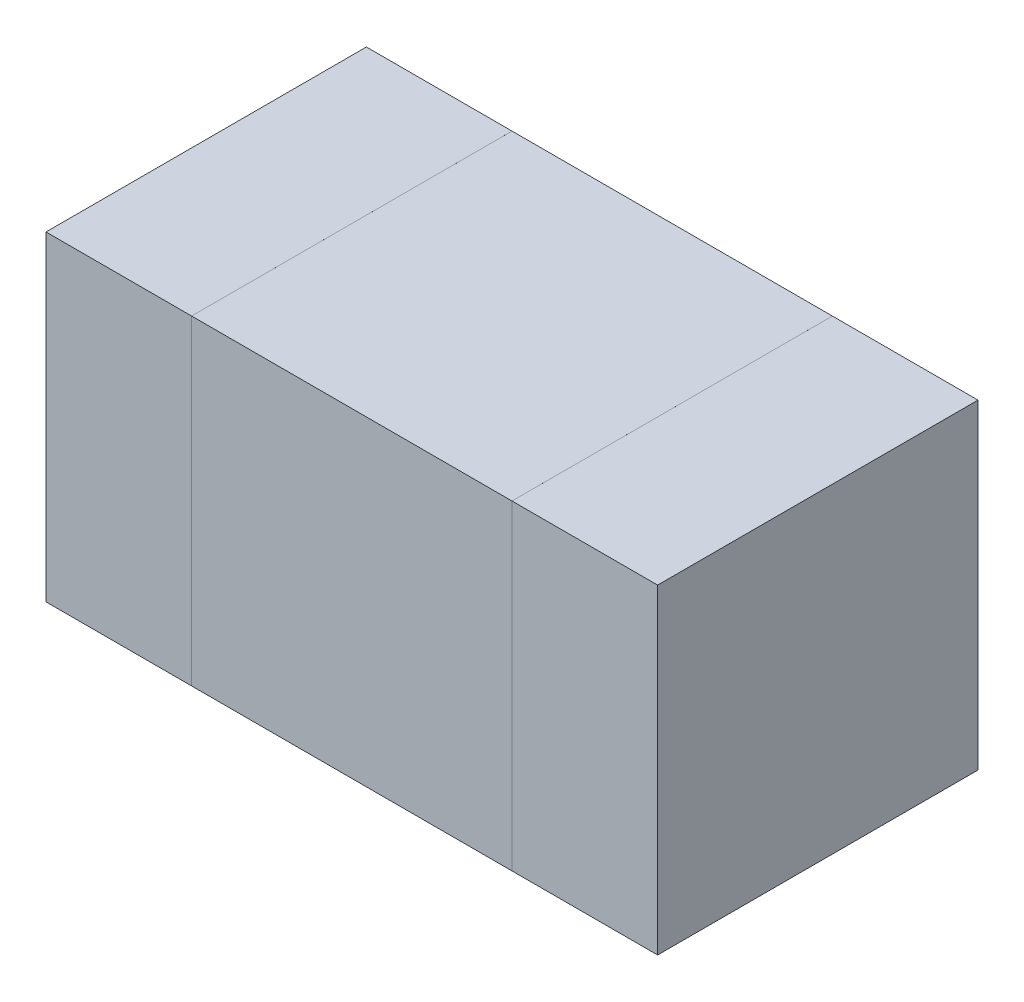
ISO-10303-21;
HEADER;
FILE_DESCRIPTION(('STEP AP214'),'2;1');
FILE_NAME('part.step','',(''),(''),'','','');
FILE_SCHEMA(('AUTOMOTIVE_DESIGN { 1 0 10303 214 1 1 1 1 }'));
ENDSEC;
DATA;
#1=APPLICATION_CONTEXT('core data for automotive mechanical design processes');
#2=APPLICATION_PROTOCOL_DEFINITION('international standard','automotive_design',2000,#1);
#3=PRODUCT_CONTEXT('',#1,'mechanical');
#4=PRODUCT('Part','Part','',(#3));
#5=PRODUCT_RELATED_PRODUCT_CATEGORY('part','',(#4));
#6=PRODUCT_DEFINITION_FORMATION('','',#4);
#7=PRODUCT_DEFINITION_CONTEXT('part definition',#1,'design');
#8=PRODUCT_DEFINITION('design','',#6,#7);
#9=PRODUCT_DEFINITION_SHAPE('','',#8);
#10=(LENGTH_UNIT() NAMED_UNIT(*) SI_UNIT(.MILLI.,.METRE.));
#11=(NAMED_UNIT(*) PLANE_ANGLE_UNIT() SI_UNIT($,.RADIAN.));
#12=(NAMED_UNIT(*) SI_UNIT($,.STERADIAN.) SOLID_ANGLE_UNIT());
#13=UNCERTAINTY_MEASURE_WITH_UNIT(LENGTH_MEASURE(1.E-05),#10,'distance_accuracy_value','');
#14=(GEOMETRIC_REPRESENTATION_CONTEXT(3) GLOBAL_UNCERTAINTY_ASSIGNED_CONTEXT((#13)) GLOBAL_UNIT_ASSIGNED_CONTEXT((#10,
#11,#12)) REPRESENTATION_CONTEXT('',''));
#15=CARTESIAN_POINT('',(0.,0.,0.));
#16=DIRECTION('',(0.,0.,1.));
#17=DIRECTION('',(1.,0.,0.));
#18=AXIS2_PLACEMENT_3D('',#15,#16,#17);
#19=CARTESIAN_POINT('',(5.709996696289,13.75999131668,0.32999934));
#20=DIRECTION('',(0.,0.,-1.));
#21=DIRECTION('',(0.,-1.,0.));
#22=AXIS2_PLACEMENT_3D('',#19,#20,#21);
#23=PLANE('',#22);
#24=DIRECTION('',(0.,1.,0.));
#25=VECTOR('',#24,1.);
#26=CARTESIAN_POINT('',(5.709996696289,13.75999131668,0.32999934));
#27=LINE('',#26,#25);
#28=CARTESIAN_POINT('',(5.709996696289,13.75999131668,0.32999934));
#29=VERTEX_POINT('',#28);
#30=CARTESIAN_POINT('',(5.709996696289,14.08999319668,0.32999934));
#31=VERTEX_POINT('',#30);
#32=EDGE_CURVE('P0_E79',#29,#31,#27,.T.);
#33=ORIENTED_EDGE('',*,*,#32,.T.);
#34=DIRECTION('',(-1.,0.,0.));
#35=VECTOR('',#34,1.);
#36=CARTESIAN_POINT('',(5.709996696289,14.08999319668,0.32999934));
#37=LINE('',#36,#35);
#38=CARTESIAN_POINT('',(5.559994456289,14.08999319668,0.32999934));
#39=VERTEX_POINT('',#38);
#40=EDGE_CURVE('P0_E105',#31,#39,#37,.T.);
#41=ORIENTED_EDGE('',*,*,#40,.T.);
#42=DIRECTION('',(0.,-1.,0.));
#43=VECTOR('',#42,1.);
#44=CARTESIAN_POINT('',(5.559994456289,14.08999319668,0.32999934));
#45=LINE('',#44,#43);
#46=CARTESIAN_POINT('',(5.559994456289,13.75999131668,0.32999934));
#47=VERTEX_POINT('',#46);
#48=EDGE_CURVE('P0_E20',#39,#47,#45,.T.);
#49=ORIENTED_EDGE('',*,*,#48,.T.);
#50=DIRECTION('',(1.,0.,0.));
#51=VECTOR('',#50,1.);
#52=CARTESIAN_POINT('',(5.559994456289,13.75999131668,0.32999934));
#53=LINE('',#52,#51);
#54=EDGE_CURVE('P0_E11',#47,#29,#53,.T.);
#55=ORIENTED_EDGE('',*,*,#54,.T.);
#56=EDGE_LOOP('',(#33,#41,#49,#55));
#57=FACE_BOUND('',#56,.T.);
#58=ADVANCED_FACE('P0_F17',(#57),#23,.F.);
#59=CARTESIAN_POINT('',(5.709996696289,13.75999131668,0.));
#60=DIRECTION('',(0.,0.,-1.));
#61=DIRECTION('',(0.,-1.,0.));
#62=AXIS2_PLACEMENT_3D('',#59,#60,#61);
#63=PLANE('',#62);
#64=DIRECTION('',(1.,0.,0.));
#65=VECTOR('',#64,1.);
#66=CARTESIAN_POINT('',(5.559994456289,13.75999131668,0.));
#67=LINE('',#66,#65);
#68=CARTESIAN_POINT('',(5.559994456289,13.75999131668,0.));
#69=VERTEX_POINT('',#68);
#70=CARTESIAN_POINT('',(5.709996696289,13.75999131668,0.));
#71=VERTEX_POINT('',#70);
#72=EDGE_CURVE('P0_E27',#69,#71,#67,.T.);
#73=ORIENTED_EDGE('',*,*,#72,.F.);
#74=DIRECTION('',(0.,-1.,0.));
#75=VECTOR('',#74,1.);
#76=CARTESIAN_POINT('',(5.559994456289,14.08999319668,0.));
#77=LINE('',#76,#75);
#78=CARTESIAN_POINT('',(5.559994456289,14.08999319668,0.));
#79=VERTEX_POINT('',#78);
#80=EDGE_CURVE('P0_E94',#79,#69,#77,.T.);
#81=ORIENTED_EDGE('',*,*,#80,.F.);
#82=DIRECTION('',(-1.,0.,0.));
#83=VECTOR('',#82,1.);
#84=CARTESIAN_POINT('',(5.709996696289,14.08999319668,0.));
#85=LINE('',#84,#83);
#86=CARTESIAN_POINT('',(5.709996696289,14.08999319668,0.));
#87=VERTEX_POINT('',#86);
#88=EDGE_CURVE('P0_E81',#87,#79,#85,.T.);
#89=ORIENTED_EDGE('',*,*,#88,.F.);
#90=DIRECTION('',(0.,1.,0.));
#91=VECTOR('',#90,1.);
#92=CARTESIAN_POINT('',(5.709996696289,13.75999131668,0.));
#93=LINE('',#92,#91);
#94=EDGE_CURVE('P0_E77',#71,#87,#93,.T.);
#95=ORIENTED_EDGE('',*,*,#94,.F.);
#96=EDGE_LOOP('',(#73,#81,#89,#95));
#97=FACE_BOUND('',#96,.T.);
#98=ADVANCED_FACE('P0_F83',(#97),#63,.T.);
#99=CARTESIAN_POINT('',(5.559994456289,13.75999131668,0.));
#100=DIRECTION('',(0.,1.,0.));
#101=DIRECTION('',(1.,0.,0.));
#102=AXIS2_PLACEMENT_3D('',#99,#100,#101);
#103=PLANE('',#102);
#104=ORIENTED_EDGE('',*,*,#72,.T.);
#105=DIRECTION('',(0.,0.,1.));
#106=VECTOR('',#105,1.);
#107=CARTESIAN_POINT('',(5.709996696289,13.75999131668,0.));
#108=LINE('',#107,#106);
#109=EDGE_CURVE('P0_E64',#71,#29,#108,.T.);
#110=ORIENTED_EDGE('',*,*,#109,.T.);
#111=ORIENTED_EDGE('',*,*,#54,.F.);
#112=DIRECTION('',(0.,0.,1.));
#113=VECTOR('',#112,1.);
#114=CARTESIAN_POINT('',(5.559994456289,13.75999131668,0.));
#115=LINE('',#114,#113);
#116=EDGE_CURVE('P0_E67',#69,#47,#115,.T.);
#117=ORIENTED_EDGE('',*,*,#116,.F.);
#118=EDGE_LOOP('',(#104,#110,#111,#117));
#119=FACE_BOUND('',#118,.T.);
#120=ADVANCED_FACE('P0_F63',(#119),#103,.F.);
#121=CARTESIAN_POINT('',(5.559994456289,14.08999319668,0.));
#122=DIRECTION('',(1.,0.,0.));
#123=DIRECTION('',(0.,1.,0.));
#124=AXIS2_PLACEMENT_3D('',#121,#122,#123);
#125=PLANE('',#124);
#126=ORIENTED_EDGE('',*,*,#80,.T.);
#127=ORIENTED_EDGE('',*,*,#116,.T.);
#128=ORIENTED_EDGE('',*,*,#48,.F.);
#129=DIRECTION('',(0.,0.,1.));
#130=VECTOR('',#129,1.);
#131=CARTESIAN_POINT('',(5.559994456289,14.08999319668,0.));
#132=LINE('',#131,#130);
#133=EDGE_CURVE('P0_E102',#79,#39,#132,.T.);
#134=ORIENTED_EDGE('',*,*,#133,.F.);
#135=EDGE_LOOP('',(#126,#127,#128,#134));
#136=FACE_BOUND('',#135,.T.);
#137=ADVANCED_FACE('P0_F114',(#136),#125,.F.);
#138=CARTESIAN_POINT('',(5.709996696289,14.08999319668,0.));
#139=DIRECTION('',(0.,-1.,0.));
#140=DIRECTION('',(0.,0.,-1.));
#141=AXIS2_PLACEMENT_3D('',#138,#139,#140);
#142=PLANE('',#141);
#143=ORIENTED_EDGE('',*,*,#88,.T.);
#144=ORIENTED_EDGE('',*,*,#133,.T.);
#145=ORIENTED_EDGE('',*,*,#40,.F.);
#146=DIRECTION('',(0.,0.,1.));
#147=VECTOR('',#146,1.);
#148=CARTESIAN_POINT('',(5.709996696289,14.08999319668,0.));
#149=LINE('',#148,#147);
#150=EDGE_CURVE('P0_E87',#87,#31,#149,.T.);
#151=ORIENTED_EDGE('',*,*,#150,.F.);
#152=EDGE_LOOP('',(#143,#144,#145,#151));
#153=FACE_BOUND('',#152,.T.);
#154=ADVANCED_FACE('P0_F117',(#153),#142,.F.);
#155=CARTESIAN_POINT('',(5.709996696289,13.75999131668,0.));
#156=DIRECTION('',(-1.,0.,0.));
#157=DIRECTION('',(0.,0.,1.));
#158=AXIS2_PLACEMENT_3D('',#155,#156,#157);
#159=PLANE('',#158);
#160=ORIENTED_EDGE('',*,*,#94,.T.);
#161=ORIENTED_EDGE('',*,*,#150,.T.);
#162=ORIENTED_EDGE('',*,*,#32,.F.);
#163=ORIENTED_EDGE('',*,*,#109,.F.);
#164=EDGE_LOOP('',(#160,#161,#162,#163));
#165=FACE_BOUND('',#164,.T.);
#166=ADVANCED_FACE('P0_F75',(#165),#159,.F.);
#167=CLOSED_SHELL('',(#58,#98,#120,#137,#154,#166));
#168=MANIFOLD_SOLID_BREP('P0_B1',#167);
#169=CARTESIAN_POINT('',(6.190007682617,13.75999131668,0.32999934));
#170=DIRECTION('',(0.,0.,-1.));
#171=DIRECTION('',(0.,-1.,0.));
#172=AXIS2_PLACEMENT_3D('',#169,#170,#171);
#173=PLANE('',#172);
#174=DIRECTION('',(0.,1.,0.));
#175=VECTOR('',#174,1.);
#176=CARTESIAN_POINT('',(6.190007682617,13.75999131668,0.32999934));
#177=LINE('',#176,#175);
#178=CARTESIAN_POINT('',(6.190007682617,13.75999131668,0.32999934));
#179=VERTEX_POINT('',#178);
#180=CARTESIAN_POINT('',(6.190007682617,14.08999319668,0.32999934));
#181=VERTEX_POINT('',#180);
#182=EDGE_CURVE('P1_E76',#179,#181,#177,.T.);
#183=ORIENTED_EDGE('',*,*,#182,.T.);
#184=DIRECTION('',(-1.,0.,0.));
#185=VECTOR('',#184,1.);
#186=CARTESIAN_POINT('',(6.190007682617,14.08999319668,0.32999934));
#187=LINE('',#186,#185);
#188=CARTESIAN_POINT('',(6.040005442617,14.08999319668,0.32999934));
#189=VERTEX_POINT('',#188);
#190=EDGE_CURVE('P1_E74',#181,#189,#187,.T.);
#191=ORIENTED_EDGE('',*,*,#190,.T.);
#192=DIRECTION('',(0.,-1.,0.));
#193=VECTOR('',#192,1.);
#194=CARTESIAN_POINT('',(6.040005442617,14.08999319668,0.32999934));
#195=LINE('',#194,#193);
#196=CARTESIAN_POINT('',(6.040005442617,13.75999131668,0.32999934));
#197=VERTEX_POINT('',#196);
#198=EDGE_CURVE('P1_E63',#189,#197,#195,.T.);
#199=ORIENTED_EDGE('',*,*,#198,.T.);
#200=DIRECTION('',(1.,0.,0.));
#201=VECTOR('',#200,1.);
#202=CARTESIAN_POINT('',(6.040005442617,13.75999131668,0.32999934));
#203=LINE('',#202,#201);
#204=EDGE_CURVE('P1_E11',#197,#179,#203,.T.);
#205=ORIENTED_EDGE('',*,*,#204,.T.);
#206=EDGE_LOOP('',(#183,#191,#199,#205));
#207=FACE_BOUND('',#206,.T.);
#208=ADVANCED_FACE('P1_F17',(#207),#173,.F.);
#209=CARTESIAN_POINT('',(6.190007682617,13.75999131668,0.));
#210=DIRECTION('',(0.,0.,-1.));
#211=DIRECTION('',(0.,-1.,0.));
#212=AXIS2_PLACEMENT_3D('',#209,#210,#211);
#213=PLANE('',#212);
#214=DIRECTION('',(1.,0.,0.));
#215=VECTOR('',#214,1.);
#216=CARTESIAN_POINT('',(6.040005442617,13.75999131668,0.));
#217=LINE('',#216,#215);
#218=CARTESIAN_POINT('',(6.040005442617,13.75999131668,0.));
#219=VERTEX_POINT('',#218);
#220=CARTESIAN_POINT('',(6.190007682617,13.75999131668,0.));
#221=VERTEX_POINT('',#220);
#222=EDGE_CURVE('P1_E20',#219,#221,#217,.T.);
#223=ORIENTED_EDGE('',*,*,#222,.F.);
#224=DIRECTION('',(0.,-1.,0.));
#225=VECTOR('',#224,1.);
#226=CARTESIAN_POINT('',(6.040005442617,14.08999319668,0.));
#227=LINE('',#226,#225);
#228=CARTESIAN_POINT('',(6.040005442617,14.08999319668,0.));
#229=VERTEX_POINT('',#228);
#230=EDGE_CURVE('P1_E56',#229,#219,#227,.T.);
#231=ORIENTED_EDGE('',*,*,#230,.F.);
#232=DIRECTION('',(-1.,0.,0.));
#233=VECTOR('',#232,1.);
#234=CARTESIAN_POINT('',(6.190007682617,14.08999319668,0.));
#235=LINE('',#234,#233);
#236=CARTESIAN_POINT('',(6.190007682617,14.08999319668,0.));
#237=VERTEX_POINT('',#236);
#238=EDGE_CURVE('P1_E83',#237,#229,#235,.T.);
#239=ORIENTED_EDGE('',*,*,#238,.F.);
#240=DIRECTION('',(0.,1.,0.));
#241=VECTOR('',#240,1.);
#242=CARTESIAN_POINT('',(6.190007682617,13.75999131668,0.));
#243=LINE('',#242,#241);
#244=EDGE_CURVE('P1_E98',#221,#237,#243,.T.);
#245=ORIENTED_EDGE('',*,*,#244,.F.);
#246=EDGE_LOOP('',(#223,#231,#239,#245));
#247=FACE_BOUND('',#246,.T.);
#248=ADVANCED_FACE('P1_F113',(#247),#213,.T.);
#249=CARTESIAN_POINT('',(6.040005442617,13.75999131668,0.));
#250=DIRECTION('',(0.,1.,0.));
#251=DIRECTION('',(1.,0.,0.));
#252=AXIS2_PLACEMENT_3D('',#249,#250,#251);
#253=PLANE('',#252);
#254=ORIENTED_EDGE('',*,*,#222,.T.);
#255=DIRECTION('',(0.,0.,1.));
#256=VECTOR('',#255,1.);
#257=CARTESIAN_POINT('',(6.190007682617,13.75999131668,0.));
#258=LINE('',#257,#256);
#259=EDGE_CURVE('P1_E88',#221,#179,#258,.T.);
#260=ORIENTED_EDGE('',*,*,#259,.T.);
#261=ORIENTED_EDGE('',*,*,#204,.F.);
#262=DIRECTION('',(0.,0.,1.));
#263=VECTOR('',#262,1.);
#264=CARTESIAN_POINT('',(6.040005442617,13.75999131668,0.));
#265=LINE('',#264,#263);
#266=EDGE_CURVE('P1_E69',#219,#197,#265,.T.);
#267=ORIENTED_EDGE('',*,*,#266,.F.);
#268=EDGE_LOOP('',(#254,#260,#261,#267));
#269=FACE_BOUND('',#268,.T.);
#270=ADVANCED_FACE('P1_F119',(#269),#253,.F.);
#271=CARTESIAN_POINT('',(6.040005442617,14.08999319668,0.));
#272=DIRECTION('',(1.,0.,0.));
#273=DIRECTION('',(0.,1.,0.));
#274=AXIS2_PLACEMENT_3D('',#271,#272,#273);
#275=PLANE('',#274);
#276=ORIENTED_EDGE('',*,*,#230,.T.);
#277=ORIENTED_EDGE('',*,*,#266,.T.);
#278=ORIENTED_EDGE('',*,*,#198,.F.);
#279=DIRECTION('',(0.,0.,1.));
#280=VECTOR('',#279,1.);
#281=CARTESIAN_POINT('',(6.040005442617,14.08999319668,0.));
#282=LINE('',#281,#280);
#283=EDGE_CURVE('P1_E67',#229,#189,#282,.T.);
#284=ORIENTED_EDGE('',*,*,#283,.F.);
#285=EDGE_LOOP('',(#276,#277,#278,#284));
#286=FACE_BOUND('',#285,.T.);
#287=ADVANCED_FACE('P1_F65',(#286),#275,.F.);
#288=CARTESIAN_POINT('',(6.190007682617,14.08999319668,0.));
#289=DIRECTION('',(0.,-1.,0.));
#290=DIRECTION('',(0.,0.,-1.));
#291=AXIS2_PLACEMENT_3D('',#288,#289,#290);
#292=PLANE('',#291);
#293=ORIENTED_EDGE('',*,*,#238,.T.);
#294=ORIENTED_EDGE('',*,*,#283,.T.);
#295=ORIENTED_EDGE('',*,*,#190,.F.);
#296=DIRECTION('',(0.,0.,1.));
#297=VECTOR('',#296,1.);
#298=CARTESIAN_POINT('',(6.190007682617,14.08999319668,0.));
#299=LINE('',#298,#297);
#300=EDGE_CURVE('P1_E95',#237,#181,#299,.T.);
#301=ORIENTED_EDGE('',*,*,#300,.F.);
#302=EDGE_LOOP('',(#293,#294,#295,#301));
#303=FACE_BOUND('',#302,.T.);
#304=ADVANCED_FACE('P1_F82',(#303),#292,.F.);
#305=CARTESIAN_POINT('',(6.190007682617,13.75999131668,0.));
#306=DIRECTION('',(-1.,0.,0.));
#307=DIRECTION('',(0.,0.,1.));
#308=AXIS2_PLACEMENT_3D('',#305,#306,#307);
#309=PLANE('',#308);
#310=ORIENTED_EDGE('',*,*,#244,.T.);
#311=ORIENTED_EDGE('',*,*,#300,.T.);
#312=ORIENTED_EDGE('',*,*,#182,.F.);
#313=ORIENTED_EDGE('',*,*,#259,.F.);
#314=EDGE_LOOP('',(#310,#311,#312,#313));
#315=FACE_BOUND('',#314,.T.);
#316=ADVANCED_FACE('P1_F110',(#315),#309,.F.);
#317=CLOSED_SHELL('',(#208,#248,#270,#287,#304,#316));
#318=MANIFOLD_SOLID_BREP('P1_B1',#317);
#319=CARTESIAN_POINT('',(5.710000129453,13.75999385668,0.32999934));
#320=DIRECTION('',(0.,0.,-1.));
#321=DIRECTION('',(0.,-1.,0.));
#322=AXIS2_PLACEMENT_3D('',#319,#320,#321);
#323=PLANE('',#322);
#324=DIRECTION('',(1.,0.,0.));
#325=VECTOR('',#324,1.);
#326=CARTESIAN_POINT('',(5.710000129453,13.75999385668,0.32999934));
#327=LINE('',#326,#325);
#328=CARTESIAN_POINT('',(5.710000129453,13.75999385668,0.32999934));
#329=VERTEX_POINT('',#328);
#330=CARTESIAN_POINT('',(6.040002009453,13.75999385668,0.32999934));
#331=VERTEX_POINT('',#330);
#332=EDGE_CURVE('P2_E82',#329,#331,#327,.T.);
#333=ORIENTED_EDGE('',*,*,#332,.T.);
#334=DIRECTION('',(0.,1.,0.));
#335=VECTOR('',#334,1.);
#336=CARTESIAN_POINT('',(6.040002009453,13.75999385668,0.32999934));
#337=LINE('',#336,#335);
#338=CARTESIAN_POINT('',(6.040002009453,14.08999319668,0.32999934));
#339=VERTEX_POINT('',#338);
#340=EDGE_CURVE('P2_E98',#331,#339,#337,.T.);
#341=ORIENTED_EDGE('',*,*,#340,.T.);
#342=DIRECTION('',(-1.,0.,0.));
#343=VECTOR('',#342,1.);
#344=CARTESIAN_POINT('',(6.040002009453,14.08999319668,0.32999934));
#345=LINE('',#344,#343);
#346=CARTESIAN_POINT('',(5.710000129453,14.08999319668,0.32999934));
#347=VERTEX_POINT('',#346);
#348=EDGE_CURVE('P2_E74',#339,#347,#345,.T.);
#349=ORIENTED_EDGE('',*,*,#348,.T.);
#350=DIRECTION('',(0.,-1.,0.));
#351=VECTOR('',#350,1.);
#352=CARTESIAN_POINT('',(5.710000129453,14.08999319668,0.32999934));
#353=LINE('',#352,#351);
#354=EDGE_CURVE('P2_E11',#347,#329,#353,.T.);
#355=ORIENTED_EDGE('',*,*,#354,.T.);
#356=EDGE_LOOP('',(#333,#341,#349,#355));
#357=FACE_BOUND('',#356,.T.);
#358=ADVANCED_FACE('P2_F17',(#357),#323,.F.);
#359=CARTESIAN_POINT('',(5.710000129453,13.75999385668,0.));
#360=DIRECTION('',(0.,0.,-1.));
#361=DIRECTION('',(0.,-1.,0.));
#362=AXIS2_PLACEMENT_3D('',#359,#360,#361);
#363=PLANE('',#362);
#364=DIRECTION('',(0.,-1.,0.));
#365=VECTOR('',#364,1.);
#366=CARTESIAN_POINT('',(5.710000129453,14.08999319668,0.));
#367=LINE('',#366,#365);
#368=CARTESIAN_POINT('',(5.710000129453,14.08999319668,0.));
#369=VERTEX_POINT('',#368);
#370=CARTESIAN_POINT('',(5.710000129453,13.75999385668,0.));
#371=VERTEX_POINT('',#370);
#372=EDGE_CURVE('P2_E25',#369,#371,#367,.T.);
#373=ORIENTED_EDGE('',*,*,#372,.F.);
#374=DIRECTION('',(-1.,0.,0.));
#375=VECTOR('',#374,1.);
#376=CARTESIAN_POINT('',(6.040002009453,14.08999319668,0.));
#377=LINE('',#376,#375);
#378=CARTESIAN_POINT('',(6.040002009453,14.08999319668,0.));
#379=VERTEX_POINT('',#378);
#380=EDGE_CURVE('P2_E102',#379,#369,#377,.T.);
#381=ORIENTED_EDGE('',*,*,#380,.F.);
#382=DIRECTION('',(0.,1.,0.));
#383=VECTOR('',#382,1.);
#384=CARTESIAN_POINT('',(6.040002009453,13.75999385668,0.));
#385=LINE('',#384,#383);
#386=CARTESIAN_POINT('',(6.040002009453,13.75999385668,0.));
#387=VERTEX_POINT('',#386);
#388=EDGE_CURVE('P2_E84',#387,#379,#385,.T.);
#389=ORIENTED_EDGE('',*,*,#388,.F.);
#390=DIRECTION('',(1.,0.,0.));
#391=VECTOR('',#390,1.);
#392=CARTESIAN_POINT('',(5.710000129453,13.75999385668,0.));
#393=LINE('',#392,#391);
#394=EDGE_CURVE('P2_E80',#371,#387,#393,.T.);
#395=ORIENTED_EDGE('',*,*,#394,.F.);
#396=EDGE_LOOP('',(#373,#381,#389,#395));
#397=FACE_BOUND('',#396,.T.);
#398=ADVANCED_FACE('P2_F86',(#397),#363,.T.);
#399=CARTESIAN_POINT('',(5.710000129453,14.08999319668,0.));
#400=DIRECTION('',(1.,0.,0.));
#401=DIRECTION('',(0.,1.,0.));
#402=AXIS2_PLACEMENT_3D('',#399,#400,#401);
#403=PLANE('',#402);
#404=ORIENTED_EDGE('',*,*,#372,.T.);
#405=DIRECTION('',(0.,0.,1.));
#406=VECTOR('',#405,1.);
#407=CARTESIAN_POINT('',(5.710000129453,13.75999385668,0.));
#408=LINE('',#407,#406);
#409=EDGE_CURVE('P2_E68',#371,#329,#408,.T.);
#410=ORIENTED_EDGE('',*,*,#409,.T.);
#411=ORIENTED_EDGE('',*,*,#354,.F.);
#412=DIRECTION('',(0.,0.,1.));
#413=VECTOR('',#412,1.);
#414=CARTESIAN_POINT('',(5.710000129453,14.08999319668,0.));
#415=LINE('',#414,#413);
#416=EDGE_CURVE('P2_E71',#369,#347,#415,.T.);
#417=ORIENTED_EDGE('',*,*,#416,.F.);
#418=EDGE_LOOP('',(#404,#410,#411,#417));
#419=FACE_BOUND('',#418,.T.);
#420=ADVANCED_FACE('P2_F67',(#419),#403,.F.);
#421=CARTESIAN_POINT('',(6.040002009453,14.08999319668,0.));
#422=DIRECTION('',(0.,-1.,0.));
#423=DIRECTION('',(0.,0.,-1.));
#424=AXIS2_PLACEMENT_3D('',#421,#422,#423);
#425=PLANE('',#424);
#426=ORIENTED_EDGE('',*,*,#380,.T.);
#427=ORIENTED_EDGE('',*,*,#416,.T.);
#428=ORIENTED_EDGE('',*,*,#348,.F.);
#429=DIRECTION('',(0.,0.,1.));
#430=VECTOR('',#429,1.);
#431=CARTESIAN_POINT('',(6.040002009453,14.08999319668,0.));
#432=LINE('',#431,#430);
#433=EDGE_CURVE('P2_E103',#379,#339,#432,.T.);
#434=ORIENTED_EDGE('',*,*,#433,.F.);
#435=EDGE_LOOP('',(#426,#427,#428,#434));
#436=FACE_BOUND('',#435,.T.);
#437=ADVANCED_FACE('P2_F117',(#436),#425,.F.);
#438=CARTESIAN_POINT('',(6.040002009453,13.75999385668,0.));
#439=DIRECTION('',(-1.,0.,0.));
#440=DIRECTION('',(0.,0.,1.));
#441=AXIS2_PLACEMENT_3D('',#438,#439,#440);
#442=PLANE('',#441);
#443=ORIENTED_EDGE('',*,*,#388,.T.);
#444=ORIENTED_EDGE('',*,*,#433,.T.);
#445=ORIENTED_EDGE('',*,*,#340,.F.);
#446=DIRECTION('',(0.,0.,1.));
#447=VECTOR('',#446,1.);
#448=CARTESIAN_POINT('',(6.040002009453,13.75999385668,0.));
#449=LINE('',#448,#447);
#450=EDGE_CURVE('P2_E90',#387,#331,#449,.T.);
#451=ORIENTED_EDGE('',*,*,#450,.F.);
#452=EDGE_LOOP('',(#443,#444,#445,#451));
#453=FACE_BOUND('',#452,.T.);
#454=ADVANCED_FACE('P2_F119',(#453),#442,.F.);
#455=CARTESIAN_POINT('',(5.710000129453,13.75999385668,0.));
#456=DIRECTION('',(0.,1.,0.));
#457=DIRECTION('',(1.,0.,0.));
#458=AXIS2_PLACEMENT_3D('',#455,#456,#457);
#459=PLANE('',#458);
#460=ORIENTED_EDGE('',*,*,#394,.T.);
#461=ORIENTED_EDGE('',*,*,#450,.T.);
#462=ORIENTED_EDGE('',*,*,#332,.F.);
#463=ORIENTED_EDGE('',*,*,#409,.F.);
#464=EDGE_LOOP('',(#460,#461,#462,#463));
#465=FACE_BOUND('',#464,.T.);
#466=ADVANCED_FACE('P2_F78',(#465),#459,.F.);
#467=CLOSED_SHELL('',(#358,#398,#420,#437,#454,#466));
#468=MANIFOLD_SOLID_BREP('P2_B1',#467);
#469=ADVANCED_BREP_SHAPE_REPRESENTATION('',(#18,#168,#318,#468),#14);
#470=SHAPE_DEFINITION_REPRESENTATION(#9,#469);
ENDSEC;
END-ISO-10303-21;
